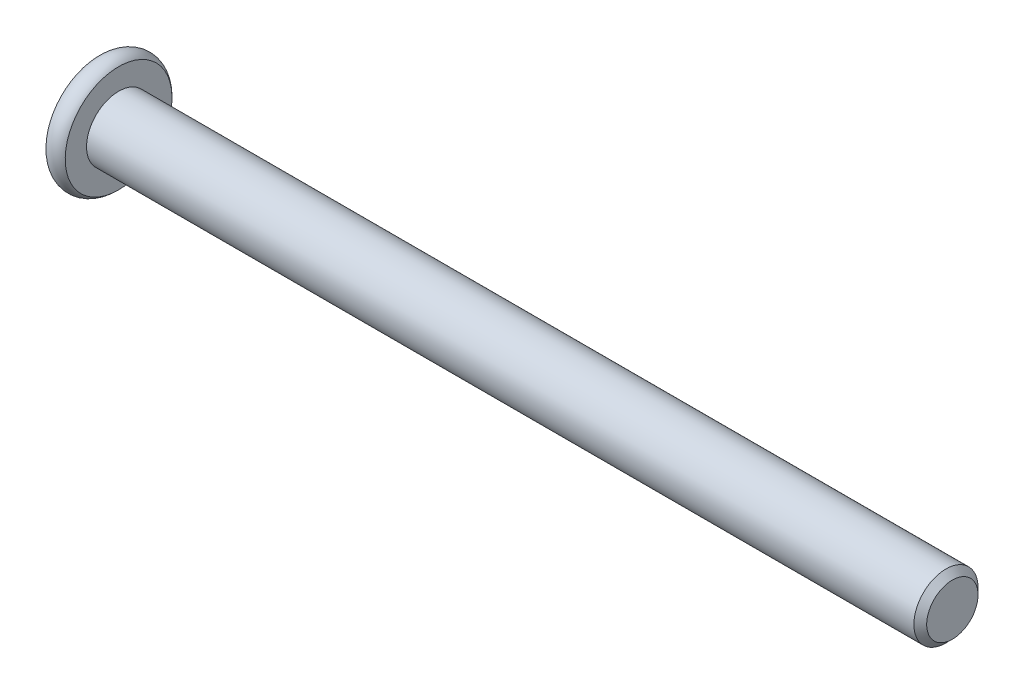
ISO-10303-21;
HEADER;
FILE_DESCRIPTION(('STEP AP214'),'2;1');
FILE_NAME('part.step','',(''),(''),'','','');
FILE_SCHEMA(('AUTOMOTIVE_DESIGN { 1 0 10303 214 1 1 1 1 }'));
ENDSEC;
DATA;
#1=APPLICATION_CONTEXT('core data for automotive mechanical design processes');
#2=APPLICATION_PROTOCOL_DEFINITION('international standard','automotive_design',2000,#1);
#3=PRODUCT_CONTEXT('',#1,'mechanical');
#4=PRODUCT('Part','Part','',(#3));
#5=PRODUCT_RELATED_PRODUCT_CATEGORY('part','',(#4));
#6=PRODUCT_DEFINITION_FORMATION('','',#4);
#7=PRODUCT_DEFINITION_CONTEXT('part definition',#1,'design');
#8=PRODUCT_DEFINITION('design','',#6,#7);
#9=PRODUCT_DEFINITION_SHAPE('','',#8);
#10=(LENGTH_UNIT() NAMED_UNIT(*) SI_UNIT(.MILLI.,.METRE.));
#11=(NAMED_UNIT(*) PLANE_ANGLE_UNIT() SI_UNIT($,.RADIAN.));
#12=(NAMED_UNIT(*) SI_UNIT($,.STERADIAN.) SOLID_ANGLE_UNIT());
#13=UNCERTAINTY_MEASURE_WITH_UNIT(LENGTH_MEASURE(1.E-05),#10,'distance_accuracy_value','');
#14=(GEOMETRIC_REPRESENTATION_CONTEXT(3) GLOBAL_UNCERTAINTY_ASSIGNED_CONTEXT((#13)) GLOBAL_UNIT_ASSIGNED_CONTEXT((#10,
#11,#12)) REPRESENTATION_CONTEXT('',''));
#15=CARTESIAN_POINT('',(0.,0.,0.));
#16=DIRECTION('',(0.,0.,1.));
#17=DIRECTION('',(1.,0.,0.));
#18=AXIS2_PLACEMENT_3D('',#15,#16,#17);
#19=CARTESIAN_POINT('',(-65.,0.,0.));
#20=DIRECTION('',(1.,0.,0.));
#21=DIRECTION('',(0.,0.,-1.));
#22=AXIS2_PLACEMENT_3D('',#19,#20,#21);
#23=CYLINDRICAL_SURFACE('',#22,2.5);
#24=CARTESIAN_POINT('',(-0.499999999999987,0.,0.));
#25=DIRECTION('',(1.,0.,0.));
#26=DIRECTION('',(0.,0.,-1.));
#27=AXIS2_PLACEMENT_3D('',#24,#25,#26);
#28=CIRCLE('',#27,2.5);
#29=CARTESIAN_POINT('',(-0.499999999999987,0.,-2.5));
#30=VERTEX_POINT('',#29);
#31=EDGE_CURVE('E50',#30,#30,#28,.F.);
#32=ORIENTED_EDGE('',*,*,#31,.T.);
#33=EDGE_LOOP('',(#32));
#34=FACE_BOUND('',#33,.T.);
#35=CARTESIAN_POINT('',(-65.,0.,0.));
#36=DIRECTION('',(-1.,0.,0.));
#37=DIRECTION('',(0.,-1.,0.));
#38=AXIS2_PLACEMENT_3D('',#35,#36,#37);
#39=CIRCLE('',#38,2.5);
#40=CARTESIAN_POINT('',(-65.,-2.50000000000001,0.));
#41=VERTEX_POINT('',#40);
#42=EDGE_CURVE('E126',#41,#41,#39,.F.);
#43=ORIENTED_EDGE('',*,*,#42,.T.);
#44=EDGE_LOOP('',(#43));
#45=FACE_BOUND('',#44,.T.);
#46=ADVANCED_FACE('F36',(#34,#45),#23,.T.);
#47=CARTESIAN_POINT('',(0.,0.,0.));
#48=DIRECTION('',(1.,0.,0.));
#49=DIRECTION('',(0.,0.,-1.));
#50=AXIS2_PLACEMENT_3D('',#47,#48,#49);
#51=PLANE('',#50);
#52=CARTESIAN_POINT('',(0.,0.,0.));
#53=DIRECTION('',(1.,0.,0.));
#54=DIRECTION('',(0.,0.,-1.));
#55=AXIS2_PLACEMENT_3D('',#52,#53,#54);
#56=CIRCLE('',#55,2.00000000000001);
#57=CARTESIAN_POINT('',(0.,0.,-2.00000000000001));
#58=VERTEX_POINT('',#57);
#59=EDGE_CURVE('E129',#58,#58,#56,.T.);
#60=ORIENTED_EDGE('',*,*,#59,.T.);
#61=EDGE_LOOP('',(#60));
#62=FACE_BOUND('',#61,.T.);
#63=ADVANCED_FACE('F139',(#62),#51,.T.);
#64=CARTESIAN_POINT('',(0.,0.,0.));
#65=DIRECTION('',(-1.,0.,0.));
#66=DIRECTION('',(0.,0.,1.));
#67=AXIS2_PLACEMENT_3D('',#64,#65,#66);
#68=CONICAL_SURFACE('',#67,2.00000000000001,0.785398163397451);
#69=ORIENTED_EDGE('',*,*,#31,.F.);
#70=EDGE_LOOP('',(#69));
#71=FACE_BOUND('',#70,.T.);
#72=ORIENTED_EDGE('',*,*,#59,.F.);
#73=EDGE_LOOP('',(#72));
#74=FACE_BOUND('',#73,.T.);
#75=ADVANCED_FACE('F38',(#71,#74),#68,.T.);
#76=CARTESIAN_POINT('',(-66.5,0.,0.));
#77=DIRECTION('',(1.,0.,0.));
#78=DIRECTION('',(0.,1.,0.));
#79=AXIS2_PLACEMENT_3D('',#76,#77,#78);
#80=PLANE('',#79);
#81=CARTESIAN_POINT('',(-66.5,2.53879038376588E-13,0.));
#82=DIRECTION('',(-1.,0.,0.));
#83=DIRECTION('',(0.,-1.,0.));
#84=AXIS2_PLACEMENT_3D('',#81,#82,#83);
#85=CIRCLE('',#84,1.7820508075688);
#86=CARTESIAN_POINT('',(-66.5,-1.78205080756855,0.));
#87=VERTEX_POINT('',#86);
#88=EDGE_CURVE('E244',#87,#87,#85,.T.);
#89=ORIENTED_EDGE('',*,*,#88,.F.);
#90=EDGE_LOOP('',(#89));
#91=FACE_BOUND('',#90,.T.);
#92=CARTESIAN_POINT('',(-66.5,0.,0.));
#93=DIRECTION('',(-1.,0.,0.));
#94=DIRECTION('',(0.,-1.,0.));
#95=AXIS2_PLACEMENT_3D('',#92,#93,#94);
#96=CIRCLE('',#95,4.16143782776615);
#97=CARTESIAN_POINT('',(-66.5,-4.16143782776615,0.));
#98=VERTEX_POINT('',#97);
#99=EDGE_CURVE('E123',#98,#98,#96,.T.);
#100=ORIENTED_EDGE('',*,*,#99,.T.);
#101=EDGE_LOOP('',(#100));
#102=FACE_BOUND('',#101,.T.);
#103=ADVANCED_FACE('F138',(#91,#102),#80,.F.);
#104=CARTESIAN_POINT('',(-65.75,0.,0.));
#105=DIRECTION('',(-1.,0.,0.));
#106=DIRECTION('',(0.,-1.,0.));
#107=AXIS2_PLACEMENT_3D('',#104,#105,#106);
#108=TOROIDAL_SURFACE('',#107,3.5,1.);
#109=ORIENTED_EDGE('',*,*,#99,.F.);
#110=EDGE_LOOP('',(#109));
#111=FACE_BOUND('',#110,.T.);
#112=CARTESIAN_POINT('',(-65.,0.,0.));
#113=DIRECTION('',(-1.,0.,0.));
#114=DIRECTION('',(0.,-1.,0.));
#115=AXIS2_PLACEMENT_3D('',#112,#113,#114);
#116=CIRCLE('',#115,4.16143782776615);
#117=CARTESIAN_POINT('',(-65.,-4.16143782776615,0.));
#118=VERTEX_POINT('',#117);
#119=EDGE_CURVE('E120',#118,#118,#116,.T.);
#120=ORIENTED_EDGE('',*,*,#119,.T.);
#121=EDGE_LOOP('',(#120));
#122=FACE_BOUND('',#121,.T.);
#123=ADVANCED_FACE('F150',(#111,#122),#108,.T.);
#124=CARTESIAN_POINT('',(-65.,4.16143782776615,0.));
#125=DIRECTION('',(-1.,0.,0.));
#126=DIRECTION('',(0.,-1.,0.));
#127=AXIS2_PLACEMENT_3D('',#124,#125,#126);
#128=PLANE('',#127);
#129=ORIENTED_EDGE('',*,*,#42,.F.);
#130=EDGE_LOOP('',(#129));
#131=FACE_BOUND('',#130,.T.);
#132=ORIENTED_EDGE('',*,*,#119,.F.);
#133=EDGE_LOOP('',(#132));
#134=FACE_BOUND('',#133,.T.);
#135=ADVANCED_FACE('F154',(#131,#134),#128,.F.);
#136=CARTESIAN_POINT('',(-66.5,2.53879038376588E-13,0.));
#137=DIRECTION('',(-1.,0.,0.));
#138=DIRECTION('',(0.,-1.,0.));
#139=AXIS2_PLACEMENT_3D('',#136,#137,#138);
#140=CONICAL_SURFACE('',#139,1.7820508075688,0.78539816339745);
#141=ORIENTED_EDGE('',*,*,#88,.T.);
#142=EDGE_LOOP('',(#141));
#143=FACE_BOUND('',#142,.T.);
#144=CARTESIAN_POINT('',(-67.015428085613,-1.74023253176552,1.5));
#145=CARTESIAN_POINT('',(-66.9833811073445,-1.69791724929705,1.5));
#146=CARTESIAN_POINT('',(-66.9516444672841,-1.65536760966767,1.5));
#147=CARTESIAN_POINT('',(-66.8889203936153,-1.5697039815666,1.5));
#148=CARTESIAN_POINT('',(-66.85793314822,-1.52658985542824,1.5));
#149=CARTESIAN_POINT('',(-66.765846164345,-1.39562626326538,1.5));
#150=CARTESIAN_POINT('',(-66.7061145123022,-1.30679868010551,1.5));
#151=CARTESIAN_POINT('',(-66.5887342891013,-1.1204462264019,1.5));
#152=CARTESIAN_POINT('',(-66.5314082774823,-1.02271587306647,1.5));
#153=CARTESIAN_POINT('',(-66.426463214976,-0.822357214965004,1.5));
#154=CARTESIAN_POINT('',(-66.3788114236897,-0.719746931701676,1.5));
#155=CARTESIAN_POINT('',(-66.3205099883151,-0.565852387094857,1.5));
#156=CARTESIAN_POINT('',(-66.303799053541,-0.516874191424445,1.5));
#157=CARTESIAN_POINT('',(-66.274307751509,-0.417723988457285,1.5));
#158=CARTESIAN_POINT('',(-66.261527651422,-0.367551900263652,1.5));
#159=CARTESIAN_POINT('',(-66.2407784202458,-0.267158299055905,1.5));
#160=CARTESIAN_POINT('',(-66.232726061826,-0.216954261864641,1.5));
#161=CARTESIAN_POINT('',(-66.2215916368341,-0.115994915871108,1.5));
#162=CARTESIAN_POINT('',(-66.2185086886378,-0.0652397064613254,1.5));
#163=CARTESIAN_POINT('',(-66.2175473897404,0.034422223487769,1.5));
#164=CARTESIAN_POINT('',(-66.2194789216952,0.0833271701103016,1.5));
#165=CARTESIAN_POINT('',(-66.2280175729677,0.180724293127433,1.5));
#166=CARTESIAN_POINT('',(-66.2346251420481,0.22921642936194,1.5));
#167=CARTESIAN_POINT('',(-66.2522650626447,0.326258027697216,1.5));
#168=CARTESIAN_POINT('',(-66.263373168201,0.374793507450233,1.5));
#169=CARTESIAN_POINT('',(-66.2894198669596,0.470802295834386,1.5));
#170=CARTESIAN_POINT('',(-66.3043581560036,0.518275688481491,1.5));
#171=CARTESIAN_POINT('',(-66.356839545716,0.667150562065347,1.5));
#172=CARTESIAN_POINT('',(-66.4003351165442,0.766448362427068,1.5));
#173=CARTESIAN_POINT('',(-66.4970587814837,0.960384405674055,1.5));
#174=CARTESIAN_POINT('',(-66.5503217226675,1.05500437383643,1.5));
#175=CARTESIAN_POINT('',(-66.6602258010454,1.23584520321554,1.5));
#176=CARTESIAN_POINT('',(-66.7165682531047,1.32224986946572,1.5));
#177=CARTESIAN_POINT('',(-66.8036755725971,1.44954953726496,1.5));
#178=CARTESIAN_POINT('',(-66.833019990684,1.49143368482446,1.5));
#179=CARTESIAN_POINT('',(-66.8924869182931,1.57462914783267,1.5));
#180=CARTESIAN_POINT('',(-66.9226092115008,1.61594061772602,1.5));
#181=CARTESIAN_POINT('',(-66.9530541181366,1.65701358742576,1.5));
#182=B_SPLINE_CURVE_WITH_KNOTS('',3,(#144,#145,#146,#147,#148,#149,#150,#151,#152,#153,#154,
#155,#156,#157,#158,#159,#160,#161,#162,#163,#164,#165,#166,#167,#168,#169,#170,#171,#172,#173,
#174,#175,#176,#177,#178,#179,#180,#181),.UNSPECIFIED.,.F.,.F.,(4,2,2,2,2,2,2,2,2,2,2,2,2,2,2,2,
2,2,4),(0.,0.159238974218347,0.318517535014534,0.639504781932381,0.979137893799198,
1.31760168934354,1.47272233841621,1.62785352839772,1.78016486537343,1.93244917778275,
2.07904486260294,2.22565464958328,2.37484213303394,2.52401777304035,2.84828365283772,
3.17372975666746,3.48303030530534,3.63644667013906,3.78982082222911),.UNSPECIFIED.);
#183=CARTESIAN_POINT('',(-66.4500000000001,-0.866025403784185,1.5));
#184=VERTEX_POINT('',#183);
#185=CARTESIAN_POINT('',(-66.4500000000001,0.866025403784695,1.5));
#186=VERTEX_POINT('',#185);
#187=EDGE_CURVE('E104',#184,#186,#182,.T.);
#188=ORIENTED_EDGE('',*,*,#187,.F.);
#189=CARTESIAN_POINT('',(-66.4501154816002,-1.73216627762246,-0.000199999999999283));
#190=CARTESIAN_POINT('',(-66.4203654760674,-1.7023935997589,0.051367790737076));
#191=CARTESIAN_POINT('',(-66.3923624839104,-1.6721230518633,0.103797917665203));
#192=CARTESIAN_POINT('',(-66.3410892304402,-1.61039789003594,0.2107090340556));
#193=CARTESIAN_POINT('',(-66.3178475050445,-1.57893740312589,0.265200195814663));
#194=CARTESIAN_POINT('',(-66.2780337289923,-1.51549879897962,0.37507908135725));
#195=CARTESIAN_POINT('',(-66.261361585671,-1.48353684526785,0.4304388090952));
#196=CARTESIAN_POINT('',(-66.2356744568182,-1.41890915196186,0.54237725747715));
#197=CARTESIAN_POINT('',(-66.226640290479,-1.38624538781093,0.598952556553007));
#198=CARTESIAN_POINT('',(-66.2184890812269,-1.32995210095274,0.696455389516438));
#199=CARTESIAN_POINT('',(-66.2172822529893,-1.30639533311099,0.737256908280464));
#200=CARTESIAN_POINT('',(-66.2193140571624,-1.25932335290168,0.818787969615855));
#201=CARTESIAN_POINT('',(-66.2225536707484,-1.23580815085288,0.859517494314627));
#202=CARTESIAN_POINT('',(-66.233291985982,-1.18900414978401,0.940584402163413));
#203=CARTESIAN_POINT('',(-66.2407946530188,-1.16571558211694,0.980921384598285));
#204=CARTESIAN_POINT('',(-66.2596516119284,-1.1195293201631,1.06091833691403));
#205=CARTESIAN_POINT('',(-66.2710075570187,-1.09663179808761,1.10057800851621));
#206=CARTESIAN_POINT('',(-66.3047216475928,-1.03798159809673,1.20216313477448));
#207=CARTESIAN_POINT('',(-66.3296218490935,-1.0025926714744,1.26345855370969));
#208=CARTESIAN_POINT('',(-66.3716566532717,-0.950557780604124,1.35358562846331));
#209=CARTESIAN_POINT('',(-66.3864251535592,-0.933410759676899,1.38328513990771));
#210=CARTESIAN_POINT('',(-66.4173105659402,-0.899432101996158,1.44213790138374));
#211=CARTESIAN_POINT('',(-66.4334268341218,-0.882600319285459,1.47129140422063));
#212=CARTESIAN_POINT('',(-66.4501154816002,-0.865909933730348,1.5002));
#213=B_SPLINE_CURVE_WITH_KNOTS('',3,(#189,#190,#191,#192,#193,#194,#195,#196,#197,#198,#199,
#200,#201,#202,#203,#204,#205,#206,#207,#208,#209,#210,#211,#212),.UNSPECIFIED.,.F.,.F.,(4,2,2,
2,2,2,2,2,2,2,2,4),(0.,0.199829143693311,0.400822987382387,0.598623720538178,0.795926240188884,
0.937113067959875,1.07833105577192,1.21968061668221,1.36109089931054,1.58570969637565,
1.69770705470962,1.80965120737193),.UNSPECIFIED.);
#214=CARTESIAN_POINT('',(-66.4500000000001,-1.73205080756862,0.));
#215=VERTEX_POINT('',#214);
#216=EDGE_CURVE('E200',#215,#184,#213,.T.);
#217=ORIENTED_EDGE('',*,*,#216,.F.);
#218=CARTESIAN_POINT('',(-66.4501154816002,-0.865909933730346,-1.5002));
#219=CARTESIAN_POINT('',(-66.4203654760674,-0.895682611593911,-1.44863220926292));
#220=CARTESIAN_POINT('',(-66.3923624839104,-0.925953159489511,-1.3962020823348));
#221=CARTESIAN_POINT('',(-66.3410892304402,-0.987678321316871,-1.2892909659444));
#222=CARTESIAN_POINT('',(-66.3178475050445,-1.01913880822692,-1.23479980418534));
#223=CARTESIAN_POINT('',(-66.2780337289923,-1.08257741237319,-1.12492091864275));
#224=CARTESIAN_POINT('',(-66.261361585671,-1.11453936608496,-1.0695611909048));
#225=CARTESIAN_POINT('',(-66.2356744568182,-1.17916705939095,-0.957622742522849));
#226=CARTESIAN_POINT('',(-66.226640290479,-1.21183082354188,-0.901047443446992));
#227=CARTESIAN_POINT('',(-66.2184890812269,-1.26812411040007,-0.80354461048356));
#228=CARTESIAN_POINT('',(-66.2172822529893,-1.29168087824182,-0.762743091719534));
#229=CARTESIAN_POINT('',(-66.2193140571624,-1.33875285845113,-0.681212030384142));
#230=CARTESIAN_POINT('',(-66.2225536707484,-1.36226806049993,-0.64048250568537));
#231=CARTESIAN_POINT('',(-66.233291985982,-1.4090720615688,-0.559415597836583));
#232=CARTESIAN_POINT('',(-66.2407946530188,-1.43236062923587,-0.519078615401711));
#233=CARTESIAN_POINT('',(-66.2596516119284,-1.47854689118971,-0.439081663085969));
#234=CARTESIAN_POINT('',(-66.2710075570187,-1.5014444132652,-0.399421991483793));
#235=CARTESIAN_POINT('',(-66.3047216475928,-1.56009461325608,-0.297836865225515));
#236=CARTESIAN_POINT('',(-66.3296218490935,-1.59548353987841,-0.236541446290309));
#237=CARTESIAN_POINT('',(-66.3716566532717,-1.64751843074869,-0.146414371536688));
#238=CARTESIAN_POINT('',(-66.3864251535592,-1.66466545167591,-0.116714860092288));
#239=CARTESIAN_POINT('',(-66.4173105659402,-1.69864410935665,-0.0578620986162567));
#240=CARTESIAN_POINT('',(-66.4334268341218,-1.71547589206735,-0.0287085957793684));
#241=CARTESIAN_POINT('',(-66.4501154816002,-1.73216627762246,0.000199999999996407));
#242=B_SPLINE_CURVE_WITH_KNOTS('',3,(#218,#219,#220,#221,#222,#223,#224,#225,#226,#227,#228,
#229,#230,#231,#232,#233,#234,#235,#236,#237,#238,#239,#240,#241),.UNSPECIFIED.,.F.,.F.,(4,2,2,
2,2,2,2,2,2,2,2,4),(0.,0.19982914369331,0.400822987382388,0.59862372053818,0.795926240188887,
0.93711306795988,1.07833105577193,1.21968061668222,1.36109089931054,1.58570969637565,
1.69770705470962,1.80965120737193),.UNSPECIFIED.);
#243=CARTESIAN_POINT('',(-66.4500000000001,-0.866025403784184,-1.5));
#244=VERTEX_POINT('',#243);
#245=EDGE_CURVE('E194',#244,#215,#242,.T.);
#246=ORIENTED_EDGE('',*,*,#245,.F.);
#247=CARTESIAN_POINT('',(-67.015428085613,-1.74023253176551,-1.5));
#248=CARTESIAN_POINT('',(-66.9833811073445,-1.69791724929705,-1.5));
#249=CARTESIAN_POINT('',(-66.9516444672841,-1.65536760966766,-1.5));
#250=CARTESIAN_POINT('',(-66.8889203936153,-1.56970398156659,-1.5));
#251=CARTESIAN_POINT('',(-66.85793314822,-1.52658985542822,-1.5));
#252=CARTESIAN_POINT('',(-66.765846164345,-1.39562626326537,-1.5));
#253=CARTESIAN_POINT('',(-66.7061145123022,-1.30679868010551,-1.5));
#254=CARTESIAN_POINT('',(-66.5887342891013,-1.12044622640191,-1.5));
#255=CARTESIAN_POINT('',(-66.5314082774823,-1.02271587306648,-1.5));
#256=CARTESIAN_POINT('',(-66.426463214976,-0.822357214965021,-1.5));
#257=CARTESIAN_POINT('',(-66.3788114236897,-0.71974693170169,-1.5));
#258=CARTESIAN_POINT('',(-66.3205099883151,-0.565852387094872,-1.5));
#259=CARTESIAN_POINT('',(-66.303799053541,-0.516874191424461,-1.5));
#260=CARTESIAN_POINT('',(-66.274307751509,-0.417723988457298,-1.5));
#261=CARTESIAN_POINT('',(-66.261527651422,-0.367551900263663,-1.5));
#262=CARTESIAN_POINT('',(-66.2407784202458,-0.267158299055913,-1.5));
#263=CARTESIAN_POINT('',(-66.232726061826,-0.216954261864649,-1.5));
#264=CARTESIAN_POINT('',(-66.2215916368341,-0.115994915871114,-1.5));
#265=CARTESIAN_POINT('',(-66.2185086886378,-0.0652397064613303,-1.5));
#266=CARTESIAN_POINT('',(-66.2175473897404,0.0344222234877651,-1.5));
#267=CARTESIAN_POINT('',(-66.2194789216952,0.0833271701102979,-1.5));
#268=CARTESIAN_POINT('',(-66.2280175729677,0.18072429312743,-1.5));
#269=CARTESIAN_POINT('',(-66.2346251420481,0.229216429361937,-1.5));
#270=CARTESIAN_POINT('',(-66.2522650626447,0.326258027697214,-1.5));
#271=CARTESIAN_POINT('',(-66.263373168201,0.374793507450232,-1.5));
#272=CARTESIAN_POINT('',(-66.2894198669596,0.470802295834385,-1.5));
#273=CARTESIAN_POINT('',(-66.3043581560036,0.518275688481491,-1.5));
#274=CARTESIAN_POINT('',(-66.356839545716,0.667150562065348,-1.5));
#275=CARTESIAN_POINT('',(-66.4003351165442,0.766448362427069,-1.5));
#276=CARTESIAN_POINT('',(-66.4970587814837,0.960384405674059,-1.5));
#277=CARTESIAN_POINT('',(-66.5503217226675,1.05500437383643,-1.5));
#278=CARTESIAN_POINT('',(-66.6602258010454,1.23584520321554,-1.5));
#279=CARTESIAN_POINT('',(-66.7165682531047,1.32224986946572,-1.5));
#280=CARTESIAN_POINT('',(-66.8036755725971,1.44954953726496,-1.5));
#281=CARTESIAN_POINT('',(-66.833019990684,1.49143368482446,-1.5));
#282=CARTESIAN_POINT('',(-66.8924869182931,1.57462914783268,-1.5));
#283=CARTESIAN_POINT('',(-66.9226092115008,1.61594061772603,-1.5));
#284=CARTESIAN_POINT('',(-66.9530541181366,1.65701358742576,-1.5));
#285=B_SPLINE_CURVE_WITH_KNOTS('',3,(#247,#248,#249,#250,#251,#252,#253,#254,#255,#256,#257,
#258,#259,#260,#261,#262,#263,#264,#265,#266,#267,#268,#269,#270,#271,#272,#273,#274,#275,#276,
#277,#278,#279,#280,#281,#282,#283,#284),.UNSPECIFIED.,.F.,.F.,(4,2,2,2,2,2,2,2,2,2,2,2,2,2,2,2,
2,2,4),(0.,0.159238974218355,0.318517535014542,0.639504781932366,0.979137893799162,
1.31760168934351,1.47272233841618,1.6278535283977,1.78016486537341,1.93244917778274,
2.07904486260292,2.22565464958327,2.37484213303393,2.52401777304034,2.84828365283771,
3.17372975666746,3.48303030530533,3.63644667013905,3.78982082222909),.UNSPECIFIED.);
#286=CARTESIAN_POINT('',(-66.4500000000001,0.866025403784693,-1.5));
#287=VERTEX_POINT('',#286);
#288=EDGE_CURVE('E57',#287,#244,#285,.F.);
#289=ORIENTED_EDGE('',*,*,#288,.F.);
#290=CARTESIAN_POINT('',(-66.4501154816001,1.73216627762297,0.000199999999999198));
#291=CARTESIAN_POINT('',(-66.4203654760674,1.7023935997594,-0.0513677907370766));
#292=CARTESIAN_POINT('',(-66.3923624839104,1.6721230518638,-0.103797917665201));
#293=CARTESIAN_POINT('',(-66.3410892304402,1.61039789003645,-0.210709034055597));
#294=CARTESIAN_POINT('',(-66.3178475050445,1.57893740312639,-0.265200195814662));
#295=CARTESIAN_POINT('',(-66.2780337289923,1.51549879898012,-0.37507908135725));
#296=CARTESIAN_POINT('',(-66.261361585671,1.48353684526835,-0.4304388090952));
#297=CARTESIAN_POINT('',(-66.2356744568182,1.41890915196237,-0.542377257477149));
#298=CARTESIAN_POINT('',(-66.2266402904789,1.38624538781144,-0.598952556553006));
#299=CARTESIAN_POINT('',(-66.2184890812269,1.32995210095325,-0.696455389516438));
#300=CARTESIAN_POINT('',(-66.2172822529893,1.30639533311149,-0.737256908280463));
#301=CARTESIAN_POINT('',(-66.2193140571624,1.25932335290219,-0.818787969615855));
#302=CARTESIAN_POINT('',(-66.2225536707484,1.23580815085339,-0.859517494314627));
#303=CARTESIAN_POINT('',(-66.233291985982,1.18900414978452,-0.940584402163413));
#304=CARTESIAN_POINT('',(-66.2407946530188,1.16571558211745,-0.980921384598284));
#305=CARTESIAN_POINT('',(-66.2596516119284,1.11952932016361,-1.06091833691403));
#306=CARTESIAN_POINT('',(-66.2710075570187,1.09663179808812,-1.1005780085162));
#307=CARTESIAN_POINT('',(-66.3047216475927,1.03798159809724,-1.20216313477448));
#308=CARTESIAN_POINT('',(-66.3296218490934,1.00259267147491,-1.26345855370969));
#309=CARTESIAN_POINT('',(-66.3716566532716,0.950557780604628,-1.35358562846331));
#310=CARTESIAN_POINT('',(-66.3864251535592,0.933410759677402,-1.38328513990772));
#311=CARTESIAN_POINT('',(-66.4173105659402,0.899432101996661,-1.44213790138375));
#312=CARTESIAN_POINT('',(-66.4334268341218,0.882600319285964,-1.47129140422064));
#313=CARTESIAN_POINT('',(-66.4501154816002,0.865909933730852,-1.5002));
#314=B_SPLINE_CURVE_WITH_KNOTS('',3,(#290,#291,#292,#293,#294,#295,#296,#297,#298,#299,#300,
#301,#302,#303,#304,#305,#306,#307,#308,#309,#310,#311,#312,#313),.UNSPECIFIED.,.F.,.F.,(4,2,2,
2,2,2,2,2,2,2,2,4),(0.,0.199829143693299,0.400822987382388,0.598623720538176,0.795926240188883,
0.937113067959875,1.07833105577192,1.21968061668221,1.36109089931054,1.58570969637565,
1.69770705470963,1.80965120737194),.UNSPECIFIED.);
#315=CARTESIAN_POINT('',(-66.4500000000001,1.73205080756913,0.));
#316=VERTEX_POINT('',#315);
#317=EDGE_CURVE('E11',#316,#287,#314,.T.);
#318=ORIENTED_EDGE('',*,*,#317,.F.);
#319=CARTESIAN_POINT('',(-66.4501154816002,0.865909933730853,1.5002));
#320=CARTESIAN_POINT('',(-66.4203654760674,0.895682611594418,1.44863220926293));
#321=CARTESIAN_POINT('',(-66.3923624839104,0.925953159490017,1.3962020823348));
#322=CARTESIAN_POINT('',(-66.3410892304402,0.987678321317375,1.28929096594441));
#323=CARTESIAN_POINT('',(-66.3178475050445,1.01913880822743,1.23479980418534));
#324=CARTESIAN_POINT('',(-66.2780337289923,1.0825774123737,1.12492091864275));
#325=CARTESIAN_POINT('',(-66.261361585671,1.11453936608547,1.0695611909048));
#326=CARTESIAN_POINT('',(-66.2356744568182,1.17916705939146,0.957622742522844));
#327=CARTESIAN_POINT('',(-66.2266402904789,1.21183082354239,0.901047443446984));
#328=CARTESIAN_POINT('',(-66.2184890812269,1.26812411040058,0.80354461048355));
#329=CARTESIAN_POINT('',(-66.2172822529893,1.29168087824234,0.762743091719524));
#330=CARTESIAN_POINT('',(-66.2193140571624,1.33875285845164,0.681212030384131));
#331=CARTESIAN_POINT('',(-66.2225536707484,1.36226806050044,0.640482505685359));
#332=CARTESIAN_POINT('',(-66.233291985982,1.40907206156931,0.559415597836573));
#333=CARTESIAN_POINT('',(-66.2407946530188,1.43236062923638,0.519078615401702));
#334=CARTESIAN_POINT('',(-66.2596516119284,1.47854689119022,0.439081663085959));
#335=CARTESIAN_POINT('',(-66.2710075570187,1.50144441326571,0.399421991483781));
#336=CARTESIAN_POINT('',(-66.3047216475927,1.56009461325659,0.297836865225506));
#337=CARTESIAN_POINT('',(-66.3296218490934,1.59548353987892,0.236541446290306));
#338=CARTESIAN_POINT('',(-66.3716566532716,1.64751843074919,0.146414371536687));
#339=CARTESIAN_POINT('',(-66.3864251535592,1.66466545167642,0.116714860092285));
#340=CARTESIAN_POINT('',(-66.4173105659402,1.69864410935716,0.0578620986162541));
#341=CARTESIAN_POINT('',(-66.4334268341218,1.71547589206786,0.028708595779367));
#342=CARTESIAN_POINT('',(-66.4501154816001,1.73216627762297,-0.000199999999995749));
#343=B_SPLINE_CURVE_WITH_KNOTS('',3,(#319,#320,#321,#322,#323,#324,#325,#326,#327,#328,#329,
#330,#331,#332,#333,#334,#335,#336,#337,#338,#339,#340,#341,#342),.UNSPECIFIED.,.F.,.F.,(4,2,2,
2,2,2,2,2,2,2,2,4),(0.,0.199829143693306,0.400822987382393,0.598623720538189,0.795926240188905,
0.937113067959897,1.07833105577194,1.21968061668224,1.36109089931056,1.58570969637566,
1.69770705470963,1.80965120737194),.UNSPECIFIED.);
#344=EDGE_CURVE('E95',#186,#316,#343,.T.);
#345=ORIENTED_EDGE('',*,*,#344,.F.);
#346=EDGE_LOOP('',(#188,#217,#246,#289,#318,#345));
#347=FACE_BOUND('',#346,.T.);
#348=ADVANCED_FACE('F94',(#143,#347),#140,.F.);
#349=CARTESIAN_POINT('',(-64.2,0.,0.));
#350=DIRECTION('',(-1.,0.,0.));
#351=DIRECTION('',(0.,0.,1.));
#352=AXIS2_PLACEMENT_3D('',#349,#350,#351);
#353=PLANE('',#352);
#354=DIRECTION('',(0.,0.5,-0.866025403784438));
#355=VECTOR('',#354,1.);
#356=CARTESIAN_POINT('',(-64.2,0.866025403784684,1.5));
#357=LINE('',#356,#355);
#358=CARTESIAN_POINT('',(-64.2,0.866025403784684,1.5));
#359=VERTEX_POINT('',#358);
#360=CARTESIAN_POINT('',(-64.2,1.73205080756912,0.));
#361=VERTEX_POINT('',#360);
#362=EDGE_CURVE('E103',#359,#361,#357,.T.);
#363=ORIENTED_EDGE('',*,*,#362,.T.);
#364=DIRECTION('',(0.,-0.5,-0.866025403784439));
#365=VECTOR('',#364,1.);
#366=CARTESIAN_POINT('',(-64.2,1.73205080756912,0.));
#367=LINE('',#366,#365);
#368=CARTESIAN_POINT('',(-64.2,0.866025403784684,-1.5));
#369=VERTEX_POINT('',#368);
#370=EDGE_CURVE('E108',#361,#369,#367,.T.);
#371=ORIENTED_EDGE('',*,*,#370,.T.);
#372=DIRECTION('',(0.,-1.,0.));
#373=VECTOR('',#372,1.);
#374=CARTESIAN_POINT('',(-64.2,0.866025403784684,-1.5));
#375=LINE('',#374,#373);
#376=CARTESIAN_POINT('',(-64.2,-0.866025403784193,-1.5));
#377=VERTEX_POINT('',#376);
#378=EDGE_CURVE('E226',#369,#377,#375,.T.);
#379=ORIENTED_EDGE('',*,*,#378,.T.);
#380=DIRECTION('',(0.,-0.5,0.866025403784438));
#381=VECTOR('',#380,1.);
#382=CARTESIAN_POINT('',(-64.2,-0.866025403784193,-1.5));
#383=LINE('',#382,#381);
#384=CARTESIAN_POINT('',(-64.2,-1.73205080756863,0.));
#385=VERTEX_POINT('',#384);
#386=EDGE_CURVE('E230',#377,#385,#383,.T.);
#387=ORIENTED_EDGE('',*,*,#386,.T.);
#388=DIRECTION('',(0.,0.5,0.866025403784439));
#389=VECTOR('',#388,1.);
#390=CARTESIAN_POINT('',(-64.2,-1.73205080756863,0.));
#391=LINE('',#390,#389);
#392=CARTESIAN_POINT('',(-64.2,-0.866025403784194,1.5));
#393=VERTEX_POINT('',#392);
#394=EDGE_CURVE('E116',#385,#393,#391,.T.);
#395=ORIENTED_EDGE('',*,*,#394,.T.);
#396=DIRECTION('',(0.,1.,0.));
#397=VECTOR('',#396,1.);
#398=CARTESIAN_POINT('',(-64.2,-0.866025403784194,1.5));
#399=LINE('',#398,#397);
#400=EDGE_CURVE('E111',#393,#359,#399,.T.);
#401=ORIENTED_EDGE('',*,*,#400,.T.);
#402=EDGE_LOOP('',(#363,#371,#379,#387,#395,#401));
#403=FACE_BOUND('',#402,.T.);
#404=ADVANCED_FACE('F180',(#403),#353,.T.);
#405=CARTESIAN_POINT('',(-64.2,1.73205080756912,0.));
#406=DIRECTION('',(0.,0.866025403784439,-0.5));
#407=DIRECTION('',(0.,0.5,0.866025403784439));
#408=AXIS2_PLACEMENT_3D('',#405,#406,#407);
#409=PLANE('',#408);
#410=DIRECTION('',(-1.,0.,0.));
#411=VECTOR('',#410,1.);
#412=CARTESIAN_POINT('',(-64.2,1.73205080756912,0.));
#413=LINE('',#412,#411);
#414=EDGE_CURVE('E101',#361,#316,#413,.T.);
#415=ORIENTED_EDGE('',*,*,#414,.T.);
#416=ORIENTED_EDGE('',*,*,#317,.T.);
#417=DIRECTION('',(-1.,0.,0.));
#418=VECTOR('',#417,1.);
#419=CARTESIAN_POINT('',(-64.2,0.866025403784684,-1.5));
#420=LINE('',#419,#418);
#421=EDGE_CURVE('E110',#369,#287,#420,.T.);
#422=ORIENTED_EDGE('',*,*,#421,.F.);
#423=ORIENTED_EDGE('',*,*,#370,.F.);
#424=EDGE_LOOP('',(#415,#416,#422,#423));
#425=FACE_BOUND('',#424,.T.);
#426=ADVANCED_FACE('F106',(#425),#409,.F.);
#427=CARTESIAN_POINT('',(-64.2,0.866025403784684,-1.5));
#428=DIRECTION('',(0.,0.,-1.));
#429=DIRECTION('',(-1.,0.,0.));
#430=AXIS2_PLACEMENT_3D('',#427,#428,#429);
#431=PLANE('',#430);
#432=ORIENTED_EDGE('',*,*,#421,.T.);
#433=ORIENTED_EDGE('',*,*,#288,.T.);
#434=DIRECTION('',(-1.,0.,0.));
#435=VECTOR('',#434,1.);
#436=CARTESIAN_POINT('',(-64.2,-0.866025403784193,-1.5));
#437=LINE('',#436,#435);
#438=EDGE_CURVE('E113',#377,#244,#437,.T.);
#439=ORIENTED_EDGE('',*,*,#438,.F.);
#440=ORIENTED_EDGE('',*,*,#378,.F.);
#441=EDGE_LOOP('',(#432,#433,#439,#440));
#442=FACE_BOUND('',#441,.T.);
#443=ADVANCED_FACE('F215',(#442),#431,.F.);
#444=CARTESIAN_POINT('',(-64.2,-0.866025403784193,-1.5));
#445=DIRECTION('',(0.,-0.866025403784438,-0.5));
#446=DIRECTION('',(0.,0.5,-0.866025403784438));
#447=AXIS2_PLACEMENT_3D('',#444,#445,#446);
#448=PLANE('',#447);
#449=ORIENTED_EDGE('',*,*,#438,.T.);
#450=ORIENTED_EDGE('',*,*,#245,.T.);
#451=DIRECTION('',(-1.,0.,0.));
#452=VECTOR('',#451,1.);
#453=CARTESIAN_POINT('',(-64.2,-1.73205080756863,0.));
#454=LINE('',#453,#452);
#455=EDGE_CURVE('E240',#385,#215,#454,.T.);
#456=ORIENTED_EDGE('',*,*,#455,.F.);
#457=ORIENTED_EDGE('',*,*,#386,.F.);
#458=EDGE_LOOP('',(#449,#450,#456,#457));
#459=FACE_BOUND('',#458,.T.);
#460=ADVANCED_FACE('F210',(#459),#448,.F.);
#461=CARTESIAN_POINT('',(-64.2,-1.73205080756863,0.));
#462=DIRECTION('',(0.,-0.866025403784439,0.5));
#463=DIRECTION('',(0.,-0.5,-0.866025403784439));
#464=AXIS2_PLACEMENT_3D('',#461,#462,#463);
#465=PLANE('',#464);
#466=ORIENTED_EDGE('',*,*,#455,.T.);
#467=ORIENTED_EDGE('',*,*,#216,.T.);
#468=DIRECTION('',(-1.,0.,0.));
#469=VECTOR('',#468,1.);
#470=CARTESIAN_POINT('',(-64.2,-0.866025403784194,1.5));
#471=LINE('',#470,#469);
#472=EDGE_CURVE('E237',#393,#184,#471,.T.);
#473=ORIENTED_EDGE('',*,*,#472,.F.);
#474=ORIENTED_EDGE('',*,*,#394,.F.);
#475=EDGE_LOOP('',(#466,#467,#473,#474));
#476=FACE_BOUND('',#475,.T.);
#477=ADVANCED_FACE('F207',(#476),#465,.F.);
#478=CARTESIAN_POINT('',(-64.2,-0.866025403784194,1.5));
#479=DIRECTION('',(0.,0.,1.));
#480=DIRECTION('',(1.,0.,0.));
#481=AXIS2_PLACEMENT_3D('',#478,#479,#480);
#482=PLANE('',#481);
#483=ORIENTED_EDGE('',*,*,#472,.T.);
#484=ORIENTED_EDGE('',*,*,#187,.T.);
#485=DIRECTION('',(-1.,0.,0.));
#486=VECTOR('',#485,1.);
#487=CARTESIAN_POINT('',(-64.2,0.866025403784684,1.5));
#488=LINE('',#487,#486);
#489=EDGE_CURVE('E64',#359,#186,#488,.T.);
#490=ORIENTED_EDGE('',*,*,#489,.F.);
#491=ORIENTED_EDGE('',*,*,#400,.F.);
#492=EDGE_LOOP('',(#483,#484,#490,#491));
#493=FACE_BOUND('',#492,.T.);
#494=ADVANCED_FACE('F161',(#493),#482,.F.);
#495=CARTESIAN_POINT('',(-64.2,0.866025403784684,1.5));
#496=DIRECTION('',(0.,0.866025403784439,0.5));
#497=DIRECTION('',(0.,-0.5,0.866025403784439));
#498=AXIS2_PLACEMENT_3D('',#495,#496,#497);
#499=PLANE('',#498);
#500=ORIENTED_EDGE('',*,*,#489,.T.);
#501=ORIENTED_EDGE('',*,*,#344,.T.);
#502=ORIENTED_EDGE('',*,*,#414,.F.);
#503=ORIENTED_EDGE('',*,*,#362,.F.);
#504=EDGE_LOOP('',(#500,#501,#502,#503));
#505=FACE_BOUND('',#504,.T.);
#506=ADVANCED_FACE('F100',(#505),#499,.F.);
#507=CLOSED_SHELL('',(#46,#63,#75,#103,#123,#135,#348,#404,#426,#443,#460,#477,#494,#506));
#508=MANIFOLD_SOLID_BREP('B2',#507);
#509=ADVANCED_BREP_SHAPE_REPRESENTATION('',(#18,#508),#14);
#510=SHAPE_DEFINITION_REPRESENTATION(#9,#509);
ENDSEC;
END-ISO-10303-21;
